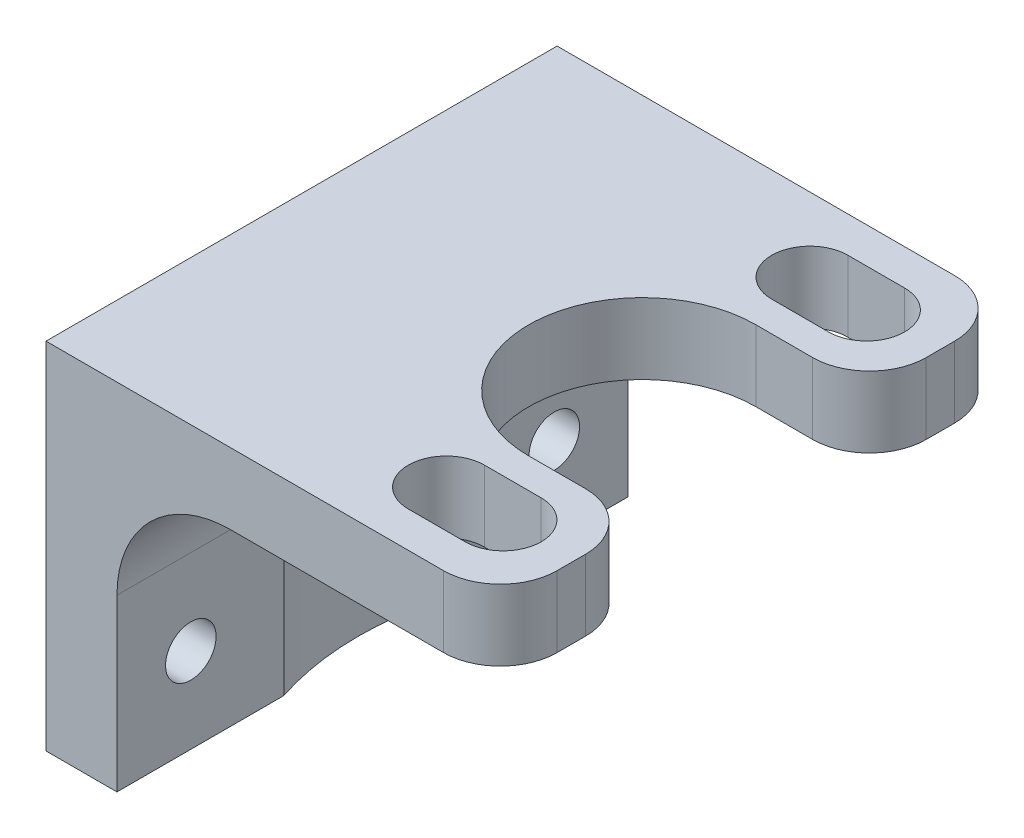
ISO-10303-21;
HEADER;
FILE_DESCRIPTION(('STEP AP214'),'2;1');
FILE_NAME('part.step','',(''),(''),'','','');
FILE_SCHEMA(('AUTOMOTIVE_DESIGN { 1 0 10303 214 1 1 1 1 }'));
ENDSEC;
DATA;
#1=APPLICATION_CONTEXT('core data for automotive mechanical design processes');
#2=APPLICATION_PROTOCOL_DEFINITION('international standard','automotive_design',2000,#1);
#3=PRODUCT_CONTEXT('',#1,'mechanical');
#4=PRODUCT('Part','Part','',(#3));
#5=PRODUCT_RELATED_PRODUCT_CATEGORY('part','',(#4));
#6=PRODUCT_DEFINITION_FORMATION('','',#4);
#7=PRODUCT_DEFINITION_CONTEXT('part definition',#1,'design');
#8=PRODUCT_DEFINITION('design','',#6,#7);
#9=PRODUCT_DEFINITION_SHAPE('','',#8);
#10=(LENGTH_UNIT() NAMED_UNIT(*) SI_UNIT(.MILLI.,.METRE.));
#11=(NAMED_UNIT(*) PLANE_ANGLE_UNIT() SI_UNIT($,.RADIAN.));
#12=(NAMED_UNIT(*) SI_UNIT($,.STERADIAN.) SOLID_ANGLE_UNIT());
#13=UNCERTAINTY_MEASURE_WITH_UNIT(LENGTH_MEASURE(1.E-05),#10,'distance_accuracy_value','');
#14=(GEOMETRIC_REPRESENTATION_CONTEXT(3) GLOBAL_UNCERTAINTY_ASSIGNED_CONTEXT((#13)) GLOBAL_UNIT_ASSIGNED_CONTEXT((#10,
#11,#12)) REPRESENTATION_CONTEXT('',''));
#15=CARTESIAN_POINT('',(0.,0.,0.));
#16=DIRECTION('',(0.,0.,1.));
#17=DIRECTION('',(1.,0.,0.));
#18=AXIS2_PLACEMENT_3D('',#15,#16,#17);
#19=CARTESIAN_POINT('',(-1.905,-5.08,0.));
#20=DIRECTION('',(0.,0.,-1.));
#21=DIRECTION('',(-1.,0.,0.));
#22=AXIS2_PLACEMENT_3D('',#19,#20,#21);
#23=CYLINDRICAL_SURFACE('',#22,5.08);
#24=CARTESIAN_POINT('',(-1.905,0.,10.6065911111912));
#25=CARTESIAN_POINT('',(-1.99596443418149,-1.01329915897046E-06,10.5466887844132));
#26=CARTESIAN_POINT('',(-2.0861340861637,-0.00244322260485966,10.4856266603058));
#27=CARTESIAN_POINT('',(-2.2646893735669,-0.0119611820117931,10.3613396064152));
#28=CARTESIAN_POINT('',(-2.35307545596892,-0.0190357559474637,10.2981152294927));
#29=CARTESIAN_POINT('',(-2.61498521640532,-0.0467997558229165,10.1056446793733));
#30=CARTESIAN_POINT('',(-2.78562618310901,-0.0740314872429836,9.97335996135179));
#31=CARTESIAN_POINT('',(-3.1164525826835,-0.143694699527984,9.70326650060102));
#32=CARTESIAN_POINT('',(-3.27672026630821,-0.185982956643509,9.56552032403289));
#33=CARTESIAN_POINT('',(-3.58800377820172,-0.284111933785825,9.28438076935319));
#34=CARTESIAN_POINT('',(-3.73901429962573,-0.33996033808965,9.14098422802204));
#35=CARTESIAN_POINT('',(-4.06981490398475,-0.47998002386457,8.81128907164102));
#36=CARTESIAN_POINT('',(-4.2467290444534,-0.56773724956672,8.62362562702776));
#37=CARTESIAN_POINT('',(-4.58488811251007,-0.759994574306441,8.24286416123916));
#38=CARTESIAN_POINT('',(-4.74612976084466,-0.864498165227075,8.04976501357092));
#39=CARTESIAN_POINT('',(-5.05379552996643,-1.08901683591521,7.65887541291587));
#40=CARTESIAN_POINT('',(-5.20013779323898,-1.20911013984939,7.46106571408954));
#41=CARTESIAN_POINT('',(-5.47720316470798,-1.46321811310087,7.06357616943074));
#42=CARTESIAN_POINT('',(-5.6079306595154,-1.59722885276305,6.86389686590006));
#43=CARTESIAN_POINT('',(-5.82593306848602,-1.84681048487803,6.51025343082133));
#44=CARTESIAN_POINT('',(-5.91631998386987,-1.95962070319113,6.35624482302585));
#45=CARTESIAN_POINT('',(-6.0879835611807,-2.19380045143656,6.04954609694954));
#46=CARTESIAN_POINT('',(-6.16925753232748,-2.31517249227548,5.89685638031667));
#47=CARTESIAN_POINT('',(-6.32222740764621,-2.56681466743316,5.59532490102736));
#48=CARTESIAN_POINT('',(-6.39396407059434,-2.6970430880394,5.44646911017335));
#49=CARTESIAN_POINT('',(-6.52790918307024,-2.96858646488772,5.15481040322741));
#50=CARTESIAN_POINT('',(-6.59012679801207,-3.10989055607807,5.01200176171065));
#51=CARTESIAN_POINT('',(-6.68913629538562,-3.36765875412946,4.7738275505998));
#52=CARTESIAN_POINT('',(-6.72830227313746,-3.48081904064943,4.67589764730949));
#53=CARTESIAN_POINT('',(-6.80034262995548,-3.71716453324485,4.48969576122306));
#54=CARTESIAN_POINT('',(-6.83321056337989,-3.84035982773388,4.40143371199532));
#55=CARTESIAN_POINT('',(-6.8853065363736,-4.07295302188119,4.25747491891597));
#56=CARTESIAN_POINT('',(-6.90594826794644,-4.18014942163848,4.19879822520508));
#57=CARTESIAN_POINT('',(-6.9408749970461,-4.40258079760138,4.0977333796737));
#58=CARTESIAN_POINT('',(-6.95519658126394,-4.51776491816841,4.05525167697404));
#59=CARTESIAN_POINT('',(-6.97188586213808,-4.70817710280017,4.00530569369846));
#60=CARTESIAN_POINT('',(-6.97673991680374,-4.78128583570145,3.99063981225697));
#61=CARTESIAN_POINT('',(-6.98332612700453,-4.92953586895697,3.97066741499163));
#62=CARTESIAN_POINT('',(-6.98503080272835,-5.00468930761968,3.96544329143358));
#63=CARTESIAN_POINT('',(-6.985,-5.08,3.96557372898299));
#64=B_SPLINE_CURVE_WITH_KNOTS('',3,(#24,#25,#26,#27,#28,#29,#30,#31,#32,#33,#34,#35,#36,#37,#38,
#39,#40,#41,#42,#43,#44,#45,#46,#47,#48,#49,#50,#51,#52,#53,#54,#55,#56,#57,#58,#59,#60,#61,#62,
#63),.UNSPECIFIED.,.F.,.F.,(4,2,2,2,2,2,2,2,2,2,2,2,2,2,2,2,2,2,2,4),(0.,0.326667923463672,
0.653252937509225,1.30511428610583,1.95093362836779,2.5971198018174,3.41324937170282,
4.22954933953037,5.05011615327995,5.87045190272281,6.50377907721026,7.13729276456552,
7.76800549759739,8.39810707448029,8.86169425554034,9.32575338331663,9.69656828582754,
10.0652074805127,10.2887386558922,10.5142111981198),.UNSPECIFIED.);
#65=CARTESIAN_POINT('',(-1.905,0.,10.6065911111912));
#66=VERTEX_POINT('',#65);
#67=CARTESIAN_POINT('',(-6.985,-5.08,3.96557372898299));
#68=VERTEX_POINT('',#67);
#69=EDGE_CURVE('E293',#66,#68,#64,.T.);
#70=ORIENTED_EDGE('',*,*,#69,.F.);
#71=DIRECTION('',(0.,0.,-1.));
#72=VECTOR('',#71,1.);
#73=CARTESIAN_POINT('',(-1.905,0.,0.));
#74=LINE('',#73,#72);
#75=CARTESIAN_POINT('',(-1.905,0.,11.43));
#76=VERTEX_POINT('',#75);
#77=EDGE_CURVE('E369',#76,#66,#74,.T.);
#78=ORIENTED_EDGE('',*,*,#77,.F.);
#79=CARTESIAN_POINT('',(-1.905,-5.08,11.43));
#80=DIRECTION('',(0.,0.,-1.));
#81=DIRECTION('',(-1.,0.,0.));
#82=AXIS2_PLACEMENT_3D('',#79,#80,#81);
#83=CIRCLE('',#82,5.08);
#84=CARTESIAN_POINT('',(-6.985,-5.08,11.43));
#85=VERTEX_POINT('',#84);
#86=EDGE_CURVE('E377',#76,#85,#83,.F.);
#87=ORIENTED_EDGE('',*,*,#86,.T.);
#88=DIRECTION('',(0.,0.,-1.));
#89=VECTOR('',#88,1.);
#90=CARTESIAN_POINT('',(-6.985,-5.08,11.43));
#91=LINE('',#90,#89);
#92=EDGE_CURVE('E372',#68,#85,#91,.F.);
#93=ORIENTED_EDGE('',*,*,#92,.F.);
#94=EDGE_LOOP('',(#70,#78,#87,#93));
#95=FACE_BOUND('',#94,.T.);
#96=ADVANCED_FACE('F35',(#95),#23,.F.);
#97=CARTESIAN_POINT('',(-6.985,-5.08,-3.965573728983));
#98=CARTESIAN_POINT('',(-6.98501243462539,-5.02313654218133,-3.96552254566352));
#99=CARTESIAN_POINT('',(-6.98404577354668,-4.96630906430899,-3.96847685033391));
#100=CARTESIAN_POINT('',(-6.98025489946552,-4.85342921322589,-3.97998947310891));
#101=CARTESIAN_POINT('',(-6.97743547061067,-4.79737522233663,-3.98853335775731));
#102=CARTESIAN_POINT('',(-6.97011176481025,-4.68754197022549,-4.01060201827622));
#103=CARTESIAN_POINT('',(-6.96564184081347,-4.63373964842225,-4.02402515567711));
#104=CARTESIAN_POINT('',(-6.95515507587846,-4.52756835071342,-4.05528297660954));
#105=CARTESIAN_POINT('',(-6.94913716928097,-4.47520038983758,-4.07312069889958));
#106=CARTESIAN_POINT('',(-6.92387138825496,-4.28128746319438,-4.14732822896197));
#107=CARTESIAN_POINT('',(-6.89998881141089,-4.14511330707712,-4.21623301029293));
#108=CARTESIAN_POINT('',(-6.84406366827373,-3.88411093667522,-4.37191441287979));
#109=CARTESIAN_POINT('',(-6.81194043205678,-3.7594124764202,-4.45886599231846));
#110=CARTESIAN_POINT('',(-6.7381720038089,-3.50992767732163,-4.65105394609583));
#111=CARTESIAN_POINT('',(-6.6959486891275,-3.38603922986691,-4.75721703069514));
#112=CARTESIAN_POINT('',(-6.60480659396756,-3.14750738494174,-4.97689626560496));
#113=CARTESIAN_POINT('',(-6.55588024156267,-3.03287467912632,-5.09042065394177));
#114=CARTESIAN_POINT('',(-6.45182327018049,-2.81112600465138,-5.32195246677524));
#115=CARTESIAN_POINT('',(-6.39668962329583,-2.70401374617602,-5.43996206039276));
#116=CARTESIAN_POINT('',(-6.28049732660413,-2.49628912440213,-5.67862113169921));
#117=CARTESIAN_POINT('',(-6.21944083229487,-2.39567441849384,-5.79926963672224));
#118=CARTESIAN_POINT('',(-6.0415104049458,-2.1238094639421,-6.13690828040322));
#119=CARTESIAN_POINT('',(-5.91827619969558,-1.95874436003302,-6.35557115633619));
#120=CARTESIAN_POINT('',(-5.65324384806655,-1.6450062202385,-6.79361271993009));
#121=CARTESIAN_POINT('',(-5.51143298944789,-1.49634453894597,-7.0129917965347));
#122=CARTESIAN_POINT('',(-5.20909683250229,-1.21582506629335,-7.44949327212334));
#123=CARTESIAN_POINT('',(-5.04857786037841,-1.08396162594724,-7.66661640706656));
#124=CARTESIAN_POINT('',(-4.70860032812132,-0.838522265570046,-8.0961883263207));
#125=CARTESIAN_POINT('',(-4.52915346915027,-0.724935155593786,-8.30863990153236));
#126=CARTESIAN_POINT('',(-4.2043466633807,-0.547522091522572,-8.66787017022752));
#127=CARTESIAN_POINT('',(-4.06357055896515,-0.478680721355011,-8.81633321809537));
#128=CARTESIAN_POINT('',(-3.77226558939357,-0.352962332949804,-9.10878550725363));
#129=CARTESIAN_POINT('',(-3.62173573239785,-0.296086533972524,-9.25277429135542));
#130=CARTESIAN_POINT('',(-3.31184578002247,-0.195985100213568,-9.5347074888234));
#131=CARTESIAN_POINT('',(-3.15252041982383,-0.15270973506796,-9.67267229642921));
#132=CARTESIAN_POINT('',(-2.82521002125021,-0.0812364278571495,-9.94195633346605));
#133=CARTESIAN_POINT('',(-2.65723124166651,-0.0530277517689098,-10.0732802335569));
#134=CARTESIAN_POINT('',(-2.39088753474402,-0.0223946207728884,-10.2708183973745));
#135=CARTESIAN_POINT('',(-2.29518650662456,-0.0140796503677234,-10.3397555459607));
#136=CARTESIAN_POINT('',(-2.10163732038624,-0.00288146443852575,-10.4751160628789));
#137=CARTESIAN_POINT('',(-2.00378803305032,-1.17829318203772E-06,-10.5415380566138));
#138=CARTESIAN_POINT('',(-1.90499999999999,0.,-10.6065911111912));
#139=B_SPLINE_CURVE_WITH_KNOTS('',3,(#97,#98,#99,#100,#101,#102,#103,#104,#105,#106,#107,#108,
#109,#110,#111,#112,#113,#114,#115,#116,#117,#118,#119,#120,#121,#122,#123,#124,#125,#126,#127,
#128,#129,#130,#131,#132,#133,#134,#135,#136,#137,#138),.UNSPECIFIED.,.F.,.F.,(4,2,2,2,2,2,2,2,
2,2,2,2,2,2,2,2,2,2,2,2,4),(0.,0.170447919280657,0.340457434671443,0.507111396928136,
0.67388039527551,1.13435083683149,1.59951344248259,2.10431202434874,2.60968561524757,
3.11530680341125,3.62074466665622,4.52081530958416,5.42150513165724,6.32189126173355,
7.2217240023538,7.8687986389446,8.51593917884467,9.16068513310825,9.80497113359638,
10.159530539132,10.5142810031246),.UNSPECIFIED.);
#140=CARTESIAN_POINT('',(-6.985,-5.08,-3.96557372898299));
#141=VERTEX_POINT('',#140);
#142=CARTESIAN_POINT('',(-1.90499999999999,0.,-10.6065911111912));
#143=VERTEX_POINT('',#142);
#144=EDGE_CURVE('E274',#141,#143,#139,.T.);
#145=ORIENTED_EDGE('',*,*,#144,.F.);
#146=CARTESIAN_POINT('',(-6.98499999999999,-5.08,-11.43));
#147=VERTEX_POINT('',#146);
#148=EDGE_CURVE('E374',#147,#141,#91,.F.);
#149=ORIENTED_EDGE('',*,*,#148,.F.);
#150=CARTESIAN_POINT('',(-1.90499999999999,-5.08,-11.43));
#151=DIRECTION('',(0.,0.,1.));
#152=DIRECTION('',(1.,0.,0.));
#153=AXIS2_PLACEMENT_3D('',#150,#151,#152);
#154=CIRCLE('',#153,5.08);
#155=CARTESIAN_POINT('',(-1.90499999999999,0.,-11.43));
#156=VERTEX_POINT('',#155);
#157=EDGE_CURVE('E380',#147,#156,#154,.F.);
#158=ORIENTED_EDGE('',*,*,#157,.T.);
#159=EDGE_CURVE('E373',#143,#156,#74,.T.);
#160=ORIENTED_EDGE('',*,*,#159,.F.);
#161=EDGE_LOOP('',(#145,#149,#158,#160));
#162=FACE_BOUND('',#161,.T.);
#163=ADVANCED_FACE('F417',(#162),#23,.F.);
#164=CARTESIAN_POINT('',(-6.985,-12.7,11.43));
#165=DIRECTION('',(-1.,0.,0.));
#166=DIRECTION('',(0.,0.,1.));
#167=AXIS2_PLACEMENT_3D('',#164,#165,#166);
#168=PLANE('',#167);
#169=CARTESIAN_POINT('',(-6.985,-8.89,8.128));
#170=DIRECTION('',(1.,0.,0.));
#171=DIRECTION('',(0.,0.,-1.));
#172=AXIS2_PLACEMENT_3D('',#169,#170,#171);
#173=CIRCLE('',#172,1.13029999999999);
#174=CARTESIAN_POINT('',(-6.985,-8.89,6.99770000000001));
#175=VERTEX_POINT('',#174);
#176=EDGE_CURVE('E249',#175,#175,#173,.T.);
#177=ORIENTED_EDGE('',*,*,#176,.F.);
#178=EDGE_LOOP('',(#177));
#179=FACE_BOUND('',#178,.T.);
#180=DIRECTION('',(0.,1.,0.));
#181=VECTOR('',#180,1.);
#182=CARTESIAN_POINT('',(-6.985,-12.7,3.96557372898299));
#183=LINE('',#182,#181);
#184=CARTESIAN_POINT('',(-6.985,-12.7,3.96557372898299));
#185=VERTEX_POINT('',#184);
#186=EDGE_CURVE('E280',#68,#185,#183,.F.);
#187=ORIENTED_EDGE('',*,*,#186,.F.);
#188=ORIENTED_EDGE('',*,*,#92,.T.);
#189=DIRECTION('',(0.,1.,0.));
#190=VECTOR('',#189,1.);
#191=CARTESIAN_POINT('',(-6.985,-12.7,11.43));
#192=LINE('',#191,#190);
#193=CARTESIAN_POINT('',(-6.985,-12.7,11.43));
#194=VERTEX_POINT('',#193);
#195=EDGE_CURVE('E310',#194,#85,#192,.T.);
#196=ORIENTED_EDGE('',*,*,#195,.F.);
#197=DIRECTION('',(0.,0.,1.));
#198=VECTOR('',#197,1.);
#199=CARTESIAN_POINT('',(-6.985,-12.7,11.43));
#200=LINE('',#199,#198);
#201=EDGE_CURVE('E303',#185,#194,#200,.T.);
#202=ORIENTED_EDGE('',*,*,#201,.F.);
#203=EDGE_LOOP('',(#187,#188,#196,#202));
#204=FACE_BOUND('',#203,.T.);
#205=ADVANCED_FACE('F422',(#179,#204),#168,.F.);
#206=CARTESIAN_POINT('',(-6.98499999999999,-8.89,-8.128));
#207=DIRECTION('',(1.,0.,0.));
#208=DIRECTION('',(0.,0.,-1.));
#209=AXIS2_PLACEMENT_3D('',#206,#207,#208);
#210=CIRCLE('',#209,1.13029999999999);
#211=CARTESIAN_POINT('',(-6.98499999999999,-8.89,-9.25829999999999));
#212=VERTEX_POINT('',#211);
#213=EDGE_CURVE('E261',#212,#212,#210,.T.);
#214=ORIENTED_EDGE('',*,*,#213,.F.);
#215=EDGE_LOOP('',(#214));
#216=FACE_BOUND('',#215,.T.);
#217=DIRECTION('',(0.,1.,0.));
#218=VECTOR('',#217,1.);
#219=CARTESIAN_POINT('',(-6.985,-12.7,-3.96557372898299));
#220=LINE('',#219,#218);
#221=CARTESIAN_POINT('',(-6.985,-12.7,-3.96557372898299));
#222=VERTEX_POINT('',#221);
#223=EDGE_CURVE('E270',#222,#141,#220,.T.);
#224=ORIENTED_EDGE('',*,*,#223,.F.);
#225=CARTESIAN_POINT('',(-6.98499999999999,-12.7,-11.43));
#226=VERTEX_POINT('',#225);
#227=EDGE_CURVE('E304',#226,#222,#200,.T.);
#228=ORIENTED_EDGE('',*,*,#227,.F.);
#229=DIRECTION('',(0.,1.,0.));
#230=VECTOR('',#229,1.);
#231=CARTESIAN_POINT('',(-6.98499999999999,-12.7,-11.43));
#232=LINE('',#231,#230);
#233=EDGE_CURVE('E324',#226,#147,#232,.T.);
#234=ORIENTED_EDGE('',*,*,#233,.T.);
#235=ORIENTED_EDGE('',*,*,#148,.T.);
#236=EDGE_LOOP('',(#224,#228,#234,#235));
#237=FACE_BOUND('',#236,.T.);
#238=ADVANCED_FACE('F452',(#216,#237),#168,.F.);
#239=CARTESIAN_POINT('',(7.62,3.175,-7.62));
#240=DIRECTION('',(0.,-1.,0.));
#241=DIRECTION('',(0.,0.,-1.));
#242=AXIS2_PLACEMENT_3D('',#239,#240,#241);
#243=CYLINDRICAL_SURFACE('',#242,2.54);
#244=DIRECTION('',(0.,-1.,0.));
#245=VECTOR('',#244,1.);
#246=CARTESIAN_POINT('',(10.16,3.175,-7.62));
#247=LINE('',#246,#245);
#248=CARTESIAN_POINT('',(10.16,3.175,-7.62000000000001));
#249=VERTEX_POINT('',#248);
#250=CARTESIAN_POINT('',(10.16,0.,-7.62000000000001));
#251=VERTEX_POINT('',#250);
#252=EDGE_CURVE('E464',#249,#251,#247,.T.);
#253=ORIENTED_EDGE('',*,*,#252,.F.);
#254=CARTESIAN_POINT('',(7.62,3.175,-7.62));
#255=DIRECTION('',(0.,-1.,0.));
#256=DIRECTION('',(0.,0.,-1.));
#257=AXIS2_PLACEMENT_3D('',#254,#255,#256);
#258=CIRCLE('',#257,2.54);
#259=CARTESIAN_POINT('',(7.62,3.175,-5.08));
#260=VERTEX_POINT('',#259);
#261=EDGE_CURVE('E456',#260,#249,#258,.F.);
#262=ORIENTED_EDGE('',*,*,#261,.F.);
#263=DIRECTION('',(0.,-1.,0.));
#264=VECTOR('',#263,1.);
#265=CARTESIAN_POINT('',(7.62,3.175,-5.08));
#266=LINE('',#265,#264);
#267=CARTESIAN_POINT('',(7.62,0.,-5.08));
#268=VERTEX_POINT('',#267);
#269=EDGE_CURVE('E460',#268,#260,#266,.F.);
#270=ORIENTED_EDGE('',*,*,#269,.F.);
#271=CARTESIAN_POINT('',(7.62,0.,-7.62));
#272=DIRECTION('',(0.,-1.,0.));
#273=DIRECTION('',(0.,0.,-1.));
#274=AXIS2_PLACEMENT_3D('',#271,#272,#273);
#275=CIRCLE('',#274,2.54);
#276=EDGE_CURVE('E358',#251,#268,#275,.T.);
#277=ORIENTED_EDGE('',*,*,#276,.F.);
#278=EDGE_LOOP('',(#253,#262,#270,#277));
#279=FACE_BOUND('',#278,.T.);
#280=ADVANCED_FACE('F516',(#279),#243,.T.);
#281=CARTESIAN_POINT('',(7.62,3.175,7.62));
#282=DIRECTION('',(0.,1.,0.));
#283=DIRECTION('',(0.,0.,1.));
#284=AXIS2_PLACEMENT_3D('',#281,#282,#283);
#285=CYLINDRICAL_SURFACE('',#284,2.54);
#286=DIRECTION('',(0.,1.,0.));
#287=VECTOR('',#286,1.);
#288=CARTESIAN_POINT('',(10.16,3.175,7.62));
#289=LINE('',#288,#287);
#290=CARTESIAN_POINT('',(10.16,0.,7.62));
#291=VERTEX_POINT('',#290);
#292=CARTESIAN_POINT('',(10.16,3.175,7.62));
#293=VERTEX_POINT('',#292);
#294=EDGE_CURVE('E476',#291,#293,#289,.T.);
#295=ORIENTED_EDGE('',*,*,#294,.F.);
#296=CARTESIAN_POINT('',(7.62,0.,7.62));
#297=DIRECTION('',(0.,-1.,0.));
#298=DIRECTION('',(0.,0.,-1.));
#299=AXIS2_PLACEMENT_3D('',#296,#297,#298);
#300=CIRCLE('',#299,2.54);
#301=CARTESIAN_POINT('',(7.62,0.,5.08));
#302=VERTEX_POINT('',#301);
#303=EDGE_CURVE('E471',#302,#291,#300,.T.);
#304=ORIENTED_EDGE('',*,*,#303,.F.);
#305=DIRECTION('',(0.,1.,0.));
#306=VECTOR('',#305,1.);
#307=CARTESIAN_POINT('',(7.62,3.175,5.08));
#308=LINE('',#307,#306);
#309=CARTESIAN_POINT('',(7.62,3.175,5.08));
#310=VERTEX_POINT('',#309);
#311=EDGE_CURVE('E473',#310,#302,#308,.F.);
#312=ORIENTED_EDGE('',*,*,#311,.F.);
#313=CARTESIAN_POINT('',(7.62,3.175,7.62));
#314=DIRECTION('',(0.,-1.,0.));
#315=DIRECTION('',(0.,0.,-1.));
#316=AXIS2_PLACEMENT_3D('',#313,#314,#315);
#317=CIRCLE('',#316,2.54);
#318=EDGE_CURVE('E469',#293,#310,#317,.F.);
#319=ORIENTED_EDGE('',*,*,#318,.F.);
#320=EDGE_LOOP('',(#295,#304,#312,#319));
#321=FACE_BOUND('',#320,.T.);
#322=ADVANCED_FACE('F532',(#321),#285,.T.);
#323=CARTESIAN_POINT('',(10.16,3.175,11.43));
#324=DIRECTION('',(-1.,0.,0.));
#325=DIRECTION('',(0.,0.,1.));
#326=AXIS2_PLACEMENT_3D('',#323,#324,#325);
#327=PLANE('',#326);
#328=DIRECTION('',(0.,0.,-1.));
#329=VECTOR('',#328,1.);
#330=CARTESIAN_POINT('',(10.16,0.,11.43));
#331=LINE('',#330,#329);
#332=CARTESIAN_POINT('',(10.16,0.,8.89));
#333=VERTEX_POINT('',#332);
#334=EDGE_CURVE('E346',#333,#291,#331,.T.);
#335=ORIENTED_EDGE('',*,*,#334,.T.);
#336=ORIENTED_EDGE('',*,*,#294,.T.);
#337=DIRECTION('',(0.,0.,-1.));
#338=VECTOR('',#337,1.);
#339=CARTESIAN_POINT('',(10.16,3.175,11.43));
#340=LINE('',#339,#338);
#341=CARTESIAN_POINT('',(10.16,3.175,8.89));
#342=VERTEX_POINT('',#341);
#343=EDGE_CURVE('E334',#342,#293,#340,.T.);
#344=ORIENTED_EDGE('',*,*,#343,.F.);
#345=DIRECTION('',(0.,-1.,0.));
#346=VECTOR('',#345,1.);
#347=CARTESIAN_POINT('',(10.16,3.175,8.89));
#348=LINE('',#347,#346);
#349=EDGE_CURVE('E483',#342,#333,#348,.T.);
#350=ORIENTED_EDGE('',*,*,#349,.T.);
#351=EDGE_LOOP('',(#335,#336,#344,#350));
#352=FACE_BOUND('',#351,.T.);
#353=ADVANCED_FACE('F534',(#352),#327,.F.);
#354=CARTESIAN_POINT('',(7.62,3.175,8.89));
#355=DIRECTION('',(0.,-1.,0.));
#356=DIRECTION('',(0.,0.,-1.));
#357=AXIS2_PLACEMENT_3D('',#354,#355,#356);
#358=CYLINDRICAL_SURFACE('',#357,2.54);
#359=ORIENTED_EDGE('',*,*,#349,.F.);
#360=CARTESIAN_POINT('',(7.62,3.175,8.89));
#361=DIRECTION('',(0.,-1.,0.));
#362=DIRECTION('',(0.,0.,-1.));
#363=AXIS2_PLACEMENT_3D('',#360,#361,#362);
#364=CIRCLE('',#363,2.54);
#365=CARTESIAN_POINT('',(7.62,3.175,11.43));
#366=VERTEX_POINT('',#365);
#367=EDGE_CURVE('E480',#366,#342,#364,.F.);
#368=ORIENTED_EDGE('',*,*,#367,.F.);
#369=DIRECTION('',(0.,-1.,0.));
#370=VECTOR('',#369,1.);
#371=CARTESIAN_POINT('',(7.62,3.175,11.43));
#372=LINE('',#371,#370);
#373=CARTESIAN_POINT('',(7.62,0.,11.43));
#374=VERTEX_POINT('',#373);
#375=EDGE_CURVE('E440',#374,#366,#372,.F.);
#376=ORIENTED_EDGE('',*,*,#375,.F.);
#377=CARTESIAN_POINT('',(7.62,0.,8.89));
#378=DIRECTION('',(0.,-1.,0.));
#379=DIRECTION('',(0.,0.,-1.));
#380=AXIS2_PLACEMENT_3D('',#377,#378,#379);
#381=CIRCLE('',#380,2.54);
#382=EDGE_CURVE('E434',#333,#374,#381,.T.);
#383=ORIENTED_EDGE('',*,*,#382,.F.);
#384=EDGE_LOOP('',(#359,#368,#376,#383));
#385=FACE_BOUND('',#384,.T.);
#386=ADVANCED_FACE('F538',(#385),#358,.T.);
#387=CARTESIAN_POINT('',(7.62,3.175,-8.89));
#388=DIRECTION('',(0.,1.,0.));
#389=DIRECTION('',(0.,0.,1.));
#390=AXIS2_PLACEMENT_3D('',#387,#388,#389);
#391=CYLINDRICAL_SURFACE('',#390,2.54);
#392=DIRECTION('',(0.,1.,0.));
#393=VECTOR('',#392,1.);
#394=CARTESIAN_POINT('',(10.16,3.175,-8.89));
#395=LINE('',#394,#393);
#396=CARTESIAN_POINT('',(10.16,0.,-8.89));
#397=VERTEX_POINT('',#396);
#398=CARTESIAN_POINT('',(10.16,3.175,-8.89));
#399=VERTEX_POINT('',#398);
#400=EDGE_CURVE('E494',#397,#399,#395,.T.);
#401=ORIENTED_EDGE('',*,*,#400,.F.);
#402=CARTESIAN_POINT('',(7.62,0.,-8.89));
#403=DIRECTION('',(0.,-1.,0.));
#404=DIRECTION('',(0.,0.,-1.));
#405=AXIS2_PLACEMENT_3D('',#402,#403,#404);
#406=CIRCLE('',#405,2.54);
#407=CARTESIAN_POINT('',(7.62000000000001,0.,-11.43));
#408=VERTEX_POINT('',#407);
#409=EDGE_CURVE('E488',#408,#397,#406,.T.);
#410=ORIENTED_EDGE('',*,*,#409,.F.);
#411=DIRECTION('',(0.,1.,0.));
#412=VECTOR('',#411,1.);
#413=CARTESIAN_POINT('',(7.62,3.175,-11.43));
#414=LINE('',#413,#412);
#415=CARTESIAN_POINT('',(7.62000000000001,3.175,-11.43));
#416=VERTEX_POINT('',#415);
#417=EDGE_CURVE('E491',#416,#408,#414,.F.);
#418=ORIENTED_EDGE('',*,*,#417,.F.);
#419=CARTESIAN_POINT('',(7.62,3.175,-8.89));
#420=DIRECTION('',(0.,-1.,0.));
#421=DIRECTION('',(0.,0.,-1.));
#422=AXIS2_PLACEMENT_3D('',#419,#420,#421);
#423=CIRCLE('',#422,2.54);
#424=EDGE_CURVE('E486',#399,#416,#423,.F.);
#425=ORIENTED_EDGE('',*,*,#424,.F.);
#426=EDGE_LOOP('',(#401,#410,#418,#425));
#427=FACE_BOUND('',#426,.T.);
#428=ADVANCED_FACE('F511',(#427),#391,.T.);
#429=EDGE_CURVE('E338',#249,#399,#340,.T.);
#430=ORIENTED_EDGE('',*,*,#429,.F.);
#431=ORIENTED_EDGE('',*,*,#252,.T.);
#432=EDGE_CURVE('E331',#251,#397,#331,.T.);
#433=ORIENTED_EDGE('',*,*,#432,.T.);
#434=ORIENTED_EDGE('',*,*,#400,.T.);
#435=EDGE_LOOP('',(#430,#431,#433,#434));
#436=FACE_BOUND('',#435,.T.);
#437=ADVANCED_FACE('F514',(#436),#327,.F.);
#438=CARTESIAN_POINT('',(-10.16,3.175,-11.43));
#439=DIRECTION('',(0.,0.,1.));
#440=DIRECTION('',(1.,0.,0.));
#441=AXIS2_PLACEMENT_3D('',#438,#439,#440);
#442=PLANE('',#441);
#443=DIRECTION('',(-1.,0.,0.));
#444=VECTOR('',#443,1.);
#445=CARTESIAN_POINT('',(-10.16,3.175,-11.43));
#446=LINE('',#445,#444);
#447=CARTESIAN_POINT('',(-10.16,3.175,-11.43));
#448=VERTEX_POINT('',#447);
#449=EDGE_CURVE('E337',#416,#448,#446,.T.);
#450=ORIENTED_EDGE('',*,*,#449,.F.);
#451=ORIENTED_EDGE('',*,*,#417,.T.);
#452=DIRECTION('',(-1.,0.,0.));
#453=VECTOR('',#452,1.);
#454=CARTESIAN_POINT('',(-10.16,0.,-11.43));
#455=LINE('',#454,#453);
#456=EDGE_CURVE('E349',#408,#156,#455,.T.);
#457=ORIENTED_EDGE('',*,*,#456,.T.);
#458=ORIENTED_EDGE('',*,*,#157,.F.);
#459=ORIENTED_EDGE('',*,*,#233,.F.);
#460=DIRECTION('',(1.,0.,0.));
#461=VECTOR('',#460,1.);
#462=CARTESIAN_POINT('',(-10.16,-12.7,-11.43));
#463=LINE('',#462,#461);
#464=CARTESIAN_POINT('',(-10.16,-12.7,-11.43));
#465=VERTEX_POINT('',#464);
#466=EDGE_CURVE('E301',#465,#226,#463,.T.);
#467=ORIENTED_EDGE('',*,*,#466,.F.);
#468=DIRECTION('',(0.,-1.,0.));
#469=VECTOR('',#468,1.);
#470=CARTESIAN_POINT('',(-10.16,3.175,-11.43));
#471=LINE('',#470,#469);
#472=EDGE_CURVE('E497',#448,#465,#471,.T.);
#473=ORIENTED_EDGE('',*,*,#472,.F.);
#474=EDGE_LOOP('',(#450,#451,#457,#458,#459,#467,#473));
#475=FACE_BOUND('',#474,.T.);
#476=ADVANCED_FACE('F506',(#475),#442,.F.);
#477=CARTESIAN_POINT('',(-10.16,3.175,11.43));
#478=DIRECTION('',(1.,0.,0.));
#479=DIRECTION('',(0.,0.,-1.));
#480=AXIS2_PLACEMENT_3D('',#477,#478,#479);
#481=PLANE('',#480);
#482=CARTESIAN_POINT('',(-10.16,-8.89,8.128));
#483=DIRECTION('',(1.,0.,0.));
#484=DIRECTION('',(0.,0.,-1.));
#485=AXIS2_PLACEMENT_3D('',#482,#483,#484);
#486=CIRCLE('',#485,1.1303);
#487=CARTESIAN_POINT('',(-10.16,-8.89,6.9977));
#488=VERTEX_POINT('',#487);
#489=EDGE_CURVE('E258',#488,#488,#486,.T.);
#490=ORIENTED_EDGE('',*,*,#489,.T.);
#491=EDGE_LOOP('',(#490));
#492=FACE_BOUND('',#491,.T.);
#493=CARTESIAN_POINT('',(-10.16,-8.89,-8.128));
#494=DIRECTION('',(1.,0.,0.));
#495=DIRECTION('',(0.,0.,-1.));
#496=AXIS2_PLACEMENT_3D('',#493,#494,#495);
#497=CIRCLE('',#496,1.1303);
#498=CARTESIAN_POINT('',(-10.16,-8.89,-9.2583));
#499=VERTEX_POINT('',#498);
#500=EDGE_CURVE('E264',#499,#499,#497,.T.);
#501=ORIENTED_EDGE('',*,*,#500,.T.);
#502=EDGE_LOOP('',(#501));
#503=FACE_BOUND('',#502,.T.);
#504=ORIENTED_EDGE('',*,*,#472,.T.);
#505=DIRECTION('',(0.,0.,-1.));
#506=VECTOR('',#505,1.);
#507=CARTESIAN_POINT('',(-10.16,-12.7,11.43));
#508=LINE('',#507,#506);
#509=CARTESIAN_POINT('',(-10.16,-12.7,11.43));
#510=VERTEX_POINT('',#509);
#511=EDGE_CURVE('E298',#510,#465,#508,.T.);
#512=ORIENTED_EDGE('',*,*,#511,.F.);
#513=DIRECTION('',(0.,-1.,0.));
#514=VECTOR('',#513,1.);
#515=CARTESIAN_POINT('',(-10.16,3.175,11.43));
#516=LINE('',#515,#514);
#517=CARTESIAN_POINT('',(-10.16,3.175,11.43));
#518=VERTEX_POINT('',#517);
#519=EDGE_CURVE('E345',#518,#510,#516,.T.);
#520=ORIENTED_EDGE('',*,*,#519,.F.);
#521=DIRECTION('',(0.,0.,1.));
#522=VECTOR('',#521,1.);
#523=CARTESIAN_POINT('',(-10.16,3.175,11.43));
#524=LINE('',#523,#522);
#525=EDGE_CURVE('E340',#448,#518,#524,.T.);
#526=ORIENTED_EDGE('',*,*,#525,.F.);
#527=EDGE_LOOP('',(#504,#512,#520,#526));
#528=FACE_BOUND('',#527,.T.);
#529=ADVANCED_FACE('F502',(#492,#503,#528),#481,.F.);
#530=CARTESIAN_POINT('',(-10.16,3.175,11.43));
#531=DIRECTION('',(0.,0.,-1.));
#532=DIRECTION('',(-1.,0.,0.));
#533=AXIS2_PLACEMENT_3D('',#530,#531,#532);
#534=PLANE('',#533);
#535=ORIENTED_EDGE('',*,*,#86,.F.);
#536=DIRECTION('',(1.,0.,0.));
#537=VECTOR('',#536,1.);
#538=CARTESIAN_POINT('',(-10.16,0.,11.43));
#539=LINE('',#538,#537);
#540=EDGE_CURVE('E357',#76,#374,#539,.T.);
#541=ORIENTED_EDGE('',*,*,#540,.T.);
#542=ORIENTED_EDGE('',*,*,#375,.T.);
#543=DIRECTION('',(1.,0.,0.));
#544=VECTOR('',#543,1.);
#545=CARTESIAN_POINT('',(-10.16,3.175,11.43));
#546=LINE('',#545,#544);
#547=EDGE_CURVE('E342',#518,#366,#546,.T.);
#548=ORIENTED_EDGE('',*,*,#547,.F.);
#549=ORIENTED_EDGE('',*,*,#519,.T.);
#550=DIRECTION('',(-1.,0.,0.));
#551=VECTOR('',#550,1.);
#552=CARTESIAN_POINT('',(-10.16,-12.7,11.43));
#553=LINE('',#552,#551);
#554=EDGE_CURVE('E307',#194,#510,#553,.T.);
#555=ORIENTED_EDGE('',*,*,#554,.F.);
#556=ORIENTED_EDGE('',*,*,#195,.T.);
#557=EDGE_LOOP('',(#535,#541,#542,#548,#549,#555,#556));
#558=FACE_BOUND('',#557,.T.);
#559=ADVANCED_FACE('F438',(#558),#534,.F.);
#560=CARTESIAN_POINT('',(0.,3.175,0.));
#561=DIRECTION('',(0.,-1.,0.));
#562=DIRECTION('',(0.,0.,-1.));
#563=AXIS2_PLACEMENT_3D('',#560,#561,#562);
#564=PLANE('',#563);
#565=DIRECTION('',(-1.,0.,0.));
#566=VECTOR('',#565,1.);
#567=CARTESIAN_POINT('',(6.985,3.175,-9.8298));
#568=LINE('',#567,#566);
#569=CARTESIAN_POINT('',(6.985,3.175,-9.8298));
#570=VERTEX_POINT('',#569);
#571=CARTESIAN_POINT('',(4.445,3.175,-9.8298));
#572=VERTEX_POINT('',#571);
#573=EDGE_CURVE('E219',#570,#572,#568,.T.);
#574=ORIENTED_EDGE('',*,*,#573,.F.);
#575=CARTESIAN_POINT('',(6.985,3.175,-8.128));
#576=DIRECTION('',(0.,1.,0.));
#577=DIRECTION('',(0.,0.,1.));
#578=AXIS2_PLACEMENT_3D('',#575,#576,#577);
#579=CIRCLE('',#578,1.7018);
#580=CARTESIAN_POINT('',(6.985,3.175,-6.4262));
#581=VERTEX_POINT('',#580);
#582=EDGE_CURVE('E50',#581,#570,#579,.T.);
#583=ORIENTED_EDGE('',*,*,#582,.F.);
#584=DIRECTION('',(1.,0.,0.));
#585=VECTOR('',#584,1.);
#586=CARTESIAN_POINT('',(4.445,3.175,-6.4262));
#587=LINE('',#586,#585);
#588=CARTESIAN_POINT('',(4.445,3.175,-6.4262));
#589=VERTEX_POINT('',#588);
#590=EDGE_CURVE('E226',#589,#581,#587,.T.);
#591=ORIENTED_EDGE('',*,*,#590,.F.);
#592=CARTESIAN_POINT('',(4.445,3.175,-8.128));
#593=DIRECTION('',(0.,1.,0.));
#594=DIRECTION('',(0.,0.,1.));
#595=AXIS2_PLACEMENT_3D('',#592,#593,#594);
#596=CIRCLE('',#595,1.7018);
#597=EDGE_CURVE('E210',#572,#589,#596,.T.);
#598=ORIENTED_EDGE('',*,*,#597,.F.);
#599=EDGE_LOOP('',(#574,#583,#591,#598));
#600=FACE_BOUND('',#599,.T.);
#601=DIRECTION('',(1.,0.,0.));
#602=VECTOR('',#601,1.);
#603=CARTESIAN_POINT('',(6.985,3.175,9.8298));
#604=LINE('',#603,#602);
#605=CARTESIAN_POINT('',(4.445,3.175,9.8298));
#606=VERTEX_POINT('',#605);
#607=CARTESIAN_POINT('',(6.985,3.175,9.8298));
#608=VERTEX_POINT('',#607);
#609=EDGE_CURVE('E237',#606,#608,#604,.T.);
#610=ORIENTED_EDGE('',*,*,#609,.F.);
#611=CARTESIAN_POINT('',(4.445,3.175,8.128));
#612=DIRECTION('',(0.,1.,0.));
#613=DIRECTION('',(0.,0.,-1.));
#614=AXIS2_PLACEMENT_3D('',#611,#612,#613);
#615=CIRCLE('',#614,1.7018);
#616=CARTESIAN_POINT('',(4.445,3.175,6.4262));
#617=VERTEX_POINT('',#616);
#618=EDGE_CURVE('E233',#617,#606,#615,.T.);
#619=ORIENTED_EDGE('',*,*,#618,.F.);
#620=DIRECTION('',(-1.,0.,0.));
#621=VECTOR('',#620,1.);
#622=CARTESIAN_POINT('',(4.445,3.175,6.4262));
#623=LINE('',#622,#621);
#624=CARTESIAN_POINT('',(6.985,3.175,6.4262));
#625=VERTEX_POINT('',#624);
#626=EDGE_CURVE('E243',#625,#617,#623,.T.);
#627=ORIENTED_EDGE('',*,*,#626,.F.);
#628=CARTESIAN_POINT('',(6.985,3.175,8.128));
#629=DIRECTION('',(0.,1.,0.));
#630=DIRECTION('',(0.,0.,-1.));
#631=AXIS2_PLACEMENT_3D('',#628,#629,#630);
#632=CIRCLE('',#631,1.7018);
#633=EDGE_CURVE('E240',#608,#625,#632,.T.);
#634=ORIENTED_EDGE('',*,*,#633,.F.);
#635=EDGE_LOOP('',(#610,#619,#627,#634));
#636=FACE_BOUND('',#635,.T.);
#637=DIRECTION('',(1.,0.,0.));
#638=VECTOR('',#637,1.);
#639=CARTESIAN_POINT('',(5.08,3.175,-5.08));
#640=LINE('',#639,#638);
#641=CARTESIAN_POINT('',(5.08,3.175,-5.08));
#642=VERTEX_POINT('',#641);
#643=EDGE_CURVE('E314',#642,#260,#640,.T.);
#644=ORIENTED_EDGE('',*,*,#643,.T.);
#645=ORIENTED_EDGE('',*,*,#261,.T.);
#646=ORIENTED_EDGE('',*,*,#429,.T.);
#647=ORIENTED_EDGE('',*,*,#424,.T.);
#648=ORIENTED_EDGE('',*,*,#449,.T.);
#649=ORIENTED_EDGE('',*,*,#525,.T.);
#650=ORIENTED_EDGE('',*,*,#547,.T.);
#651=ORIENTED_EDGE('',*,*,#367,.T.);
#652=ORIENTED_EDGE('',*,*,#343,.T.);
#653=ORIENTED_EDGE('',*,*,#318,.T.);
#654=DIRECTION('',(-1.,0.,0.));
#655=VECTOR('',#654,1.);
#656=CARTESIAN_POINT('',(5.08,3.175,5.08));
#657=LINE('',#656,#655);
#658=CARTESIAN_POINT('',(5.08,3.175,5.08));
#659=VERTEX_POINT('',#658);
#660=EDGE_CURVE('E318',#310,#659,#657,.T.);
#661=ORIENTED_EDGE('',*,*,#660,.T.);
#662=CARTESIAN_POINT('',(5.08,3.175,0.));
#663=DIRECTION('',(0.,-1.,0.));
#664=DIRECTION('',(0.,0.,-1.));
#665=AXIS2_PLACEMENT_3D('',#662,#663,#664);
#666=CIRCLE('',#665,5.08);
#667=EDGE_CURVE('E311',#659,#642,#666,.T.);
#668=ORIENTED_EDGE('',*,*,#667,.T.);
#669=EDGE_LOOP('',(#644,#645,#646,#647,#648,#649,#650,#651,#652,#653,#661,#668));
#670=FACE_BOUND('',#669,.T.);
#671=ADVANCED_FACE('F223',(#600,#636,#670),#564,.F.);
#672=CARTESIAN_POINT('',(0.,0.,0.));
#673=DIRECTION('',(0.,-1.,0.));
#674=DIRECTION('',(0.,0.,-1.));
#675=AXIS2_PLACEMENT_3D('',#672,#673,#674);
#676=PLANE('',#675);
#677=CARTESIAN_POINT('',(6.985,0.,-8.128));
#678=DIRECTION('',(0.,-1.,0.));
#679=DIRECTION('',(0.,0.,-1.));
#680=AXIS2_PLACEMENT_3D('',#677,#678,#679);
#681=CIRCLE('',#680,1.7018);
#682=CARTESIAN_POINT('',(6.985,0.,-9.8298));
#683=VERTEX_POINT('',#682);
#684=CARTESIAN_POINT('',(6.985,0.,-6.4262));
#685=VERTEX_POINT('',#684);
#686=EDGE_CURVE('E11',#683,#685,#681,.T.);
#687=ORIENTED_EDGE('',*,*,#686,.F.);
#688=DIRECTION('',(1.,0.,0.));
#689=VECTOR('',#688,1.);
#690=CARTESIAN_POINT('',(0.,0.,-9.8298));
#691=LINE('',#690,#689);
#692=CARTESIAN_POINT('',(4.445,0.,-9.8298));
#693=VERTEX_POINT('',#692);
#694=EDGE_CURVE('E392',#693,#683,#691,.T.);
#695=ORIENTED_EDGE('',*,*,#694,.F.);
#696=CARTESIAN_POINT('',(4.445,0.,-8.128));
#697=DIRECTION('',(0.,-1.,0.));
#698=DIRECTION('',(0.,0.,-1.));
#699=AXIS2_PLACEMENT_3D('',#696,#697,#698);
#700=CIRCLE('',#699,1.7018);
#701=CARTESIAN_POINT('',(4.445,0.,-6.4262));
#702=VERTEX_POINT('',#701);
#703=EDGE_CURVE('E213',#702,#693,#700,.T.);
#704=ORIENTED_EDGE('',*,*,#703,.F.);
#705=DIRECTION('',(-1.,0.,0.));
#706=VECTOR('',#705,1.);
#707=CARTESIAN_POINT('',(0.,0.,-6.4262));
#708=LINE('',#707,#706);
#709=EDGE_CURVE('E43',#685,#702,#708,.T.);
#710=ORIENTED_EDGE('',*,*,#709,.F.);
#711=EDGE_LOOP('',(#687,#695,#704,#710));
#712=FACE_BOUND('',#711,.T.);
#713=CARTESIAN_POINT('',(4.445,0.,8.128));
#714=DIRECTION('',(0.,-1.,0.));
#715=DIRECTION('',(0.,0.,-1.));
#716=AXIS2_PLACEMENT_3D('',#713,#714,#715);
#717=CIRCLE('',#716,1.7018);
#718=CARTESIAN_POINT('',(4.445,0.,9.8298));
#719=VERTEX_POINT('',#718);
#720=CARTESIAN_POINT('',(4.445,0.,6.4262));
#721=VERTEX_POINT('',#720);
#722=EDGE_CURVE('E390',#719,#721,#717,.T.);
#723=ORIENTED_EDGE('',*,*,#722,.F.);
#724=DIRECTION('',(-1.,0.,0.));
#725=VECTOR('',#724,1.);
#726=CARTESIAN_POINT('',(0.,0.,9.8298));
#727=LINE('',#726,#725);
#728=CARTESIAN_POINT('',(6.985,0.,9.8298));
#729=VERTEX_POINT('',#728);
#730=EDGE_CURVE('E383',#729,#719,#727,.T.);
#731=ORIENTED_EDGE('',*,*,#730,.F.);
#732=CARTESIAN_POINT('',(6.985,0.,8.128));
#733=DIRECTION('',(0.,-1.,0.));
#734=DIRECTION('',(0.,0.,-1.));
#735=AXIS2_PLACEMENT_3D('',#732,#733,#734);
#736=CIRCLE('',#735,1.7018);
#737=CARTESIAN_POINT('',(6.985,0.,6.4262));
#738=VERTEX_POINT('',#737);
#739=EDGE_CURVE('E385',#738,#729,#736,.T.);
#740=ORIENTED_EDGE('',*,*,#739,.F.);
#741=DIRECTION('',(1.,0.,0.));
#742=VECTOR('',#741,1.);
#743=CARTESIAN_POINT('',(0.,0.,6.4262));
#744=LINE('',#743,#742);
#745=EDGE_CURVE('E388',#721,#738,#744,.T.);
#746=ORIENTED_EDGE('',*,*,#745,.F.);
#747=EDGE_LOOP('',(#723,#731,#740,#746));
#748=FACE_BOUND('',#747,.T.);
#749=ORIENTED_EDGE('',*,*,#77,.T.);
#750=CARTESIAN_POINT('',(5.08,0.,0.));
#751=DIRECTION('',(0.,-1.,0.));
#752=DIRECTION('',(0.,0.,-1.));
#753=AXIS2_PLACEMENT_3D('',#750,#751,#752);
#754=CIRCLE('',#753,12.7);
#755=EDGE_CURVE('E267',#66,#143,#754,.T.);
#756=ORIENTED_EDGE('',*,*,#755,.T.);
#757=ORIENTED_EDGE('',*,*,#159,.T.);
#758=ORIENTED_EDGE('',*,*,#456,.F.);
#759=ORIENTED_EDGE('',*,*,#409,.T.);
#760=ORIENTED_EDGE('',*,*,#432,.F.);
#761=ORIENTED_EDGE('',*,*,#276,.T.);
#762=DIRECTION('',(1.,0.,0.));
#763=VECTOR('',#762,1.);
#764=CARTESIAN_POINT('',(5.08,0.,-5.08));
#765=LINE('',#764,#763);
#766=CARTESIAN_POINT('',(5.08,0.,-5.08));
#767=VERTEX_POINT('',#766);
#768=EDGE_CURVE('E323',#767,#268,#765,.T.);
#769=ORIENTED_EDGE('',*,*,#768,.F.);
#770=CARTESIAN_POINT('',(5.08,0.,0.));
#771=DIRECTION('',(0.,-1.,0.));
#772=DIRECTION('',(0.,0.,-1.));
#773=AXIS2_PLACEMENT_3D('',#770,#771,#772);
#774=CIRCLE('',#773,5.08);
#775=CARTESIAN_POINT('',(5.08,0.,5.08));
#776=VERTEX_POINT('',#775);
#777=EDGE_CURVE('E321',#776,#767,#774,.T.);
#778=ORIENTED_EDGE('',*,*,#777,.F.);
#779=DIRECTION('',(-1.,0.,0.));
#780=VECTOR('',#779,1.);
#781=CARTESIAN_POINT('',(5.08,0.,5.08));
#782=LINE('',#781,#780);
#783=EDGE_CURVE('E315',#302,#776,#782,.T.);
#784=ORIENTED_EDGE('',*,*,#783,.F.);
#785=ORIENTED_EDGE('',*,*,#303,.T.);
#786=ORIENTED_EDGE('',*,*,#334,.F.);
#787=ORIENTED_EDGE('',*,*,#382,.T.);
#788=ORIENTED_EDGE('',*,*,#540,.F.);
#789=EDGE_LOOP('',(#749,#756,#757,#758,#759,#760,#761,#769,#778,#784,#785,#786,#787,#788));
#790=FACE_BOUND('',#789,.T.);
#791=ADVANCED_FACE('F400',(#712,#748,#790),#676,.T.);
#792=CARTESIAN_POINT('',(5.08,3.175,0.));
#793=DIRECTION('',(0.,-1.,0.));
#794=DIRECTION('',(0.,0.,-1.));
#795=AXIS2_PLACEMENT_3D('',#792,#793,#794);
#796=CYLINDRICAL_SURFACE('',#795,5.08);
#797=ORIENTED_EDGE('',*,*,#777,.T.);
#798=DIRECTION('',(0.,-1.,0.));
#799=VECTOR('',#798,1.);
#800=CARTESIAN_POINT('',(5.08,3.175,-5.08));
#801=LINE('',#800,#799);
#802=EDGE_CURVE('E320',#642,#767,#801,.T.);
#803=ORIENTED_EDGE('',*,*,#802,.F.);
#804=ORIENTED_EDGE('',*,*,#667,.F.);
#805=DIRECTION('',(0.,-1.,0.));
#806=VECTOR('',#805,1.);
#807=CARTESIAN_POINT('',(5.08,3.175,5.08));
#808=LINE('',#807,#806);
#809=EDGE_CURVE('E328',#659,#776,#808,.T.);
#810=ORIENTED_EDGE('',*,*,#809,.T.);
#811=EDGE_LOOP('',(#797,#803,#804,#810));
#812=FACE_BOUND('',#811,.T.);
#813=ADVANCED_FACE('F523',(#812),#796,.F.);
#814=CARTESIAN_POINT('',(5.08,3.175,5.08));
#815=DIRECTION('',(0.,0.,1.));
#816=DIRECTION('',(1.,0.,0.));
#817=AXIS2_PLACEMENT_3D('',#814,#815,#816);
#818=PLANE('',#817);
#819=ORIENTED_EDGE('',*,*,#660,.F.);
#820=ORIENTED_EDGE('',*,*,#311,.T.);
#821=ORIENTED_EDGE('',*,*,#783,.T.);
#822=ORIENTED_EDGE('',*,*,#809,.F.);
#823=EDGE_LOOP('',(#819,#820,#821,#822));
#824=FACE_BOUND('',#823,.T.);
#825=ADVANCED_FACE('F528',(#824),#818,.F.);
#826=CARTESIAN_POINT('',(5.08,3.175,-5.08));
#827=DIRECTION('',(0.,0.,-1.));
#828=DIRECTION('',(-1.,0.,0.));
#829=AXIS2_PLACEMENT_3D('',#826,#827,#828);
#830=PLANE('',#829);
#831=ORIENTED_EDGE('',*,*,#768,.T.);
#832=ORIENTED_EDGE('',*,*,#269,.T.);
#833=ORIENTED_EDGE('',*,*,#643,.F.);
#834=ORIENTED_EDGE('',*,*,#802,.T.);
#835=EDGE_LOOP('',(#831,#832,#833,#834));
#836=FACE_BOUND('',#835,.T.);
#837=ADVANCED_FACE('F519',(#836),#830,.F.);
#838=CARTESIAN_POINT('',(0.,-12.7,0.));
#839=DIRECTION('',(0.,-1.,0.));
#840=DIRECTION('',(0.,0.,-1.));
#841=AXIS2_PLACEMENT_3D('',#838,#839,#840);
#842=PLANE('',#841);
#843=ORIENTED_EDGE('',*,*,#227,.T.);
#844=CARTESIAN_POINT('',(5.08,-12.7,0.));
#845=DIRECTION('',(0.,-1.,0.));
#846=DIRECTION('',(0.,0.,-1.));
#847=AXIS2_PLACEMENT_3D('',#844,#845,#846);
#848=CIRCLE('',#847,12.7);
#849=EDGE_CURVE('E268',#185,#222,#848,.T.);
#850=ORIENTED_EDGE('',*,*,#849,.F.);
#851=ORIENTED_EDGE('',*,*,#201,.T.);
#852=ORIENTED_EDGE('',*,*,#554,.T.);
#853=ORIENTED_EDGE('',*,*,#511,.T.);
#854=ORIENTED_EDGE('',*,*,#466,.T.);
#855=EDGE_LOOP('',(#843,#850,#851,#852,#853,#854));
#856=FACE_BOUND('',#855,.T.);
#857=ADVANCED_FACE('F288',(#856),#842,.T.);
#858=CARTESIAN_POINT('',(5.08,-12.7,0.));
#859=DIRECTION('',(0.,1.,0.));
#860=DIRECTION('',(0.,0.,1.));
#861=AXIS2_PLACEMENT_3D('',#858,#859,#860);
#862=CYLINDRICAL_SURFACE('',#861,12.7);
#863=ORIENTED_EDGE('',*,*,#69,.T.);
#864=ORIENTED_EDGE('',*,*,#186,.T.);
#865=ORIENTED_EDGE('',*,*,#849,.T.);
#866=ORIENTED_EDGE('',*,*,#223,.T.);
#867=ORIENTED_EDGE('',*,*,#144,.T.);
#868=ORIENTED_EDGE('',*,*,#755,.F.);
#869=EDGE_LOOP('',(#863,#864,#865,#866,#867,#868));
#870=FACE_BOUND('',#869,.T.);
#871=ADVANCED_FACE('F282',(#870),#862,.F.);
#872=CARTESIAN_POINT('',(-6.985,-8.89,-8.128));
#873=DIRECTION('',(1.,0.,0.));
#874=DIRECTION('',(0.,0.,-1.));
#875=AXIS2_PLACEMENT_3D('',#872,#873,#874);
#876=CYLINDRICAL_SURFACE('',#875,1.13029999999999);
#877=ORIENTED_EDGE('',*,*,#500,.F.);
#878=EDGE_LOOP('',(#877));
#879=FACE_BOUND('',#878,.T.);
#880=ORIENTED_EDGE('',*,*,#213,.T.);
#881=EDGE_LOOP('',(#880));
#882=FACE_BOUND('',#881,.T.);
#883=ADVANCED_FACE('F287',(#879,#882),#876,.F.);
#884=CARTESIAN_POINT('',(-6.985,-8.89,8.128));
#885=DIRECTION('',(1.,0.,0.));
#886=DIRECTION('',(0.,0.,-1.));
#887=AXIS2_PLACEMENT_3D('',#884,#885,#886);
#888=CYLINDRICAL_SURFACE('',#887,1.13029999999999);
#889=ORIENTED_EDGE('',*,*,#489,.F.);
#890=EDGE_LOOP('',(#889));
#891=FACE_BOUND('',#890,.T.);
#892=ORIENTED_EDGE('',*,*,#176,.T.);
#893=EDGE_LOOP('',(#892));
#894=FACE_BOUND('',#893,.T.);
#895=ADVANCED_FACE('F592',(#891,#894),#888,.F.);
#896=CARTESIAN_POINT('',(4.445,-12.7,8.128));
#897=DIRECTION('',(0.,1.,0.));
#898=DIRECTION('',(0.,0.,1.));
#899=AXIS2_PLACEMENT_3D('',#896,#897,#898);
#900=CYLINDRICAL_SURFACE('',#899,1.7018);
#901=ORIENTED_EDGE('',*,*,#722,.T.);
#902=DIRECTION('',(0.,1.,0.));
#903=VECTOR('',#902,1.);
#904=CARTESIAN_POINT('',(4.445,-12.7,6.4262));
#905=LINE('',#904,#903);
#906=EDGE_CURVE('E247',#721,#617,#905,.T.);
#907=ORIENTED_EDGE('',*,*,#906,.T.);
#908=ORIENTED_EDGE('',*,*,#618,.T.);
#909=DIRECTION('',(0.,1.,0.));
#910=VECTOR('',#909,1.);
#911=CARTESIAN_POINT('',(4.445,-12.7,9.8298));
#912=LINE('',#911,#910);
#913=EDGE_CURVE('E246',#719,#606,#912,.T.);
#914=ORIENTED_EDGE('',*,*,#913,.F.);
#915=EDGE_LOOP('',(#901,#907,#908,#914));
#916=FACE_BOUND('',#915,.T.);
#917=ADVANCED_FACE('F599',(#916),#900,.F.);
#918=CARTESIAN_POINT('',(4.445,-12.7,6.4262));
#919=DIRECTION('',(0.,0.,-1.));
#920=DIRECTION('',(-1.,0.,0.));
#921=AXIS2_PLACEMENT_3D('',#918,#919,#920);
#922=PLANE('',#921);
#923=ORIENTED_EDGE('',*,*,#745,.T.);
#924=DIRECTION('',(0.,1.,0.));
#925=VECTOR('',#924,1.);
#926=CARTESIAN_POINT('',(6.985,-12.7,6.4262));
#927=LINE('',#926,#925);
#928=EDGE_CURVE('E250',#738,#625,#927,.T.);
#929=ORIENTED_EDGE('',*,*,#928,.T.);
#930=ORIENTED_EDGE('',*,*,#626,.T.);
#931=ORIENTED_EDGE('',*,*,#906,.F.);
#932=EDGE_LOOP('',(#923,#929,#930,#931));
#933=FACE_BOUND('',#932,.T.);
#934=ADVANCED_FACE('F606',(#933),#922,.F.);
#935=CARTESIAN_POINT('',(6.985,-12.7,8.128));
#936=DIRECTION('',(0.,1.,0.));
#937=DIRECTION('',(0.,0.,1.));
#938=AXIS2_PLACEMENT_3D('',#935,#936,#937);
#939=CYLINDRICAL_SURFACE('',#938,1.7018);
#940=ORIENTED_EDGE('',*,*,#739,.T.);
#941=DIRECTION('',(0.,1.,0.));
#942=VECTOR('',#941,1.);
#943=CARTESIAN_POINT('',(6.985,-12.7,9.8298));
#944=LINE('',#943,#942);
#945=EDGE_CURVE('E252',#729,#608,#944,.T.);
#946=ORIENTED_EDGE('',*,*,#945,.T.);
#947=ORIENTED_EDGE('',*,*,#633,.T.);
#948=ORIENTED_EDGE('',*,*,#928,.F.);
#949=EDGE_LOOP('',(#940,#946,#947,#948));
#950=FACE_BOUND('',#949,.T.);
#951=ADVANCED_FACE('F411',(#950),#939,.F.);
#952=CARTESIAN_POINT('',(6.985,-12.7,9.8298));
#953=DIRECTION('',(0.,0.,1.));
#954=DIRECTION('',(1.,0.,0.));
#955=AXIS2_PLACEMENT_3D('',#952,#953,#954);
#956=PLANE('',#955);
#957=ORIENTED_EDGE('',*,*,#730,.T.);
#958=ORIENTED_EDGE('',*,*,#913,.T.);
#959=ORIENTED_EDGE('',*,*,#609,.T.);
#960=ORIENTED_EDGE('',*,*,#945,.F.);
#961=EDGE_LOOP('',(#957,#958,#959,#960));
#962=FACE_BOUND('',#961,.T.);
#963=ADVANCED_FACE('F404',(#962),#956,.F.);
#964=CARTESIAN_POINT('',(6.985,-12.7,-8.128));
#965=DIRECTION('',(0.,1.,0.));
#966=DIRECTION('',(0.,0.,1.));
#967=AXIS2_PLACEMENT_3D('',#964,#965,#966);
#968=CYLINDRICAL_SURFACE('',#967,1.7018);
#969=ORIENTED_EDGE('',*,*,#686,.T.);
#970=DIRECTION('',(0.,1.,0.));
#971=VECTOR('',#970,1.);
#972=CARTESIAN_POINT('',(6.985,-12.7,-6.4262));
#973=LINE('',#972,#971);
#974=EDGE_CURVE('E231',#685,#581,#973,.T.);
#975=ORIENTED_EDGE('',*,*,#974,.T.);
#976=ORIENTED_EDGE('',*,*,#582,.T.);
#977=DIRECTION('',(0.,1.,0.));
#978=VECTOR('',#977,1.);
#979=CARTESIAN_POINT('',(6.985,-12.7,-9.8298));
#980=LINE('',#979,#978);
#981=EDGE_CURVE('E216',#683,#570,#980,.T.);
#982=ORIENTED_EDGE('',*,*,#981,.F.);
#983=EDGE_LOOP('',(#969,#975,#976,#982));
#984=FACE_BOUND('',#983,.T.);
#985=ADVANCED_FACE('F402',(#984),#968,.F.);
#986=CARTESIAN_POINT('',(4.445,-12.7,-6.4262));
#987=DIRECTION('',(0.,0.,1.));
#988=DIRECTION('',(1.,0.,0.));
#989=AXIS2_PLACEMENT_3D('',#986,#987,#988);
#990=PLANE('',#989);
#991=ORIENTED_EDGE('',*,*,#709,.T.);
#992=DIRECTION('',(0.,1.,0.));
#993=VECTOR('',#992,1.);
#994=CARTESIAN_POINT('',(4.445,-12.7,-6.4262));
#995=LINE('',#994,#993);
#996=EDGE_CURVE('E215',#702,#589,#995,.T.);
#997=ORIENTED_EDGE('',*,*,#996,.T.);
#998=ORIENTED_EDGE('',*,*,#590,.T.);
#999=ORIENTED_EDGE('',*,*,#974,.F.);
#1000=EDGE_LOOP('',(#991,#997,#998,#999));
#1001=FACE_BOUND('',#1000,.T.);
#1002=ADVANCED_FACE('F397',(#1001),#990,.F.);
#1003=CARTESIAN_POINT('',(4.445,-12.7,-8.128));
#1004=DIRECTION('',(0.,1.,0.));
#1005=DIRECTION('',(0.,0.,1.));
#1006=AXIS2_PLACEMENT_3D('',#1003,#1004,#1005);
#1007=CYLINDRICAL_SURFACE('',#1006,1.7018);
#1008=ORIENTED_EDGE('',*,*,#703,.T.);
#1009=DIRECTION('',(0.,1.,0.));
#1010=VECTOR('',#1009,1.);
#1011=CARTESIAN_POINT('',(4.445,-12.7,-9.8298));
#1012=LINE('',#1011,#1010);
#1013=EDGE_CURVE('E58',#693,#572,#1012,.T.);
#1014=ORIENTED_EDGE('',*,*,#1013,.T.);
#1015=ORIENTED_EDGE('',*,*,#597,.T.);
#1016=ORIENTED_EDGE('',*,*,#996,.F.);
#1017=EDGE_LOOP('',(#1008,#1014,#1015,#1016));
#1018=FACE_BOUND('',#1017,.T.);
#1019=ADVANCED_FACE('F207',(#1018),#1007,.F.);
#1020=CARTESIAN_POINT('',(6.985,-12.7,-9.8298));
#1021=DIRECTION('',(0.,0.,-1.));
#1022=DIRECTION('',(-1.,0.,0.));
#1023=AXIS2_PLACEMENT_3D('',#1020,#1021,#1022);
#1024=PLANE('',#1023);
#1025=ORIENTED_EDGE('',*,*,#694,.T.);
#1026=ORIENTED_EDGE('',*,*,#981,.T.);
#1027=ORIENTED_EDGE('',*,*,#573,.T.);
#1028=ORIENTED_EDGE('',*,*,#1013,.F.);
#1029=EDGE_LOOP('',(#1025,#1026,#1027,#1028));
#1030=FACE_BOUND('',#1029,.T.);
#1031=ADVANCED_FACE('F220',(#1030),#1024,.F.);
#1032=CLOSED_SHELL('',(#96,#163,#205,#238,#280,#322,#353,#386,#428,#437,#476,#529,#559,#671,
#791,#813,#825,#837,#857,#871,#883,#895,#917,#934,#951,#963,#985,#1002,#1019,#1031));
#1033=MANIFOLD_SOLID_BREP('B2',#1032);
#1034=ADVANCED_BREP_SHAPE_REPRESENTATION('',(#18,#1033),#14);
#1035=SHAPE_DEFINITION_REPRESENTATION(#9,#1034);
ENDSEC;
END-ISO-10303-21;
